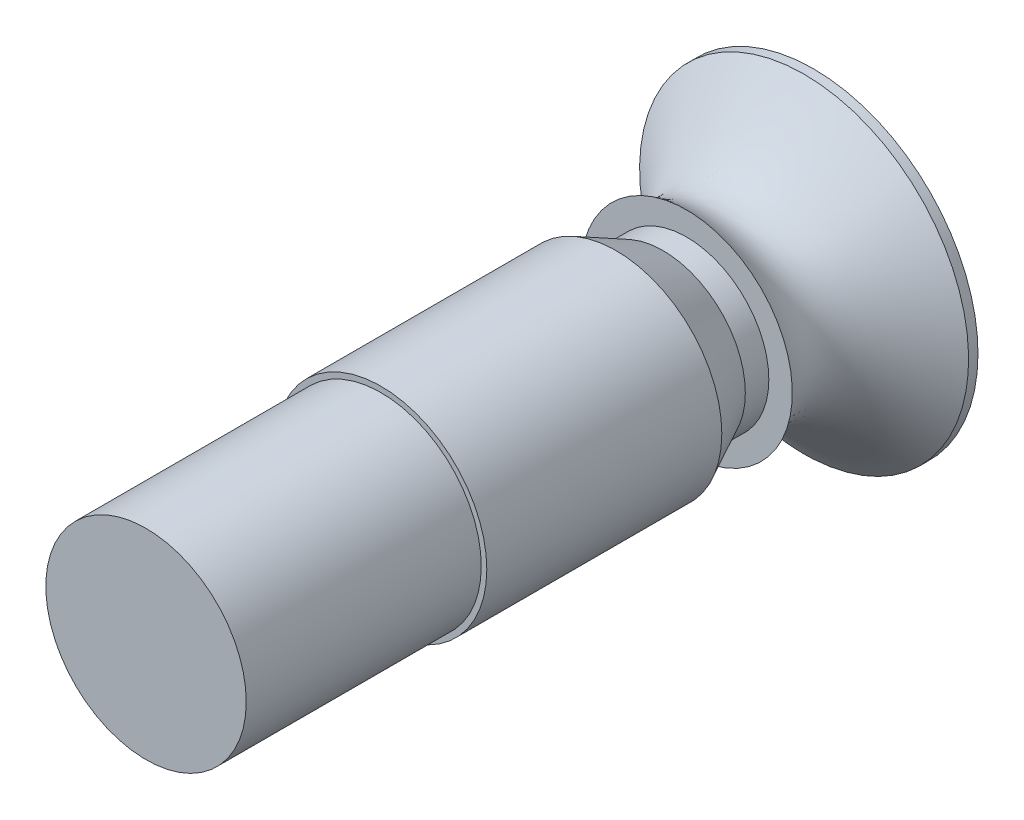
ISO-10303-21;
HEADER;
FILE_DESCRIPTION(('STEP AP214'),'2;1');
FILE_NAME('part.step','',(''),(''),'','','');
FILE_SCHEMA(('AUTOMOTIVE_DESIGN { 1 0 10303 214 1 1 1 1 }'));
ENDSEC;
DATA;
#1=APPLICATION_CONTEXT('core data for automotive mechanical design processes');
#2=APPLICATION_PROTOCOL_DEFINITION('international standard','automotive_design',2000,#1);
#3=PRODUCT_CONTEXT('',#1,'mechanical');
#4=PRODUCT('Part','Part','',(#3));
#5=PRODUCT_RELATED_PRODUCT_CATEGORY('part','',(#4));
#6=PRODUCT_DEFINITION_FORMATION('','',#4);
#7=PRODUCT_DEFINITION_CONTEXT('part definition',#1,'design');
#8=PRODUCT_DEFINITION('design','',#6,#7);
#9=PRODUCT_DEFINITION_SHAPE('','',#8);
#10=(LENGTH_UNIT() NAMED_UNIT(*) SI_UNIT(.MILLI.,.METRE.));
#11=(NAMED_UNIT(*) PLANE_ANGLE_UNIT() SI_UNIT($,.RADIAN.));
#12=(NAMED_UNIT(*) SI_UNIT($,.STERADIAN.) SOLID_ANGLE_UNIT());
#13=UNCERTAINTY_MEASURE_WITH_UNIT(LENGTH_MEASURE(1.E-05),#10,'distance_accuracy_value','');
#14=(GEOMETRIC_REPRESENTATION_CONTEXT(3) GLOBAL_UNCERTAINTY_ASSIGNED_CONTEXT((#13)) GLOBAL_UNIT_ASSIGNED_CONTEXT((#10,
#11,#12)) REPRESENTATION_CONTEXT('',''));
#15=CARTESIAN_POINT('',(0.,0.,0.));
#16=DIRECTION('',(0.,0.,1.));
#17=DIRECTION('',(1.,0.,0.));
#18=AXIS2_PLACEMENT_3D('',#15,#16,#17);
#19=CARTESIAN_POINT('',(0.,0.,2.));
#20=DIRECTION('',(0.,0.,-1.));
#21=DIRECTION('',(-1.,0.,0.));
#22=AXIS2_PLACEMENT_3D('',#19,#20,#21);
#23=CYLINDRICAL_SURFACE('',#22,35.);
#24=CARTESIAN_POINT('',(0.,0.,2.));
#25=DIRECTION('',(0.,0.,-1.));
#26=DIRECTION('',(-1.,0.,0.));
#27=AXIS2_PLACEMENT_3D('',#24,#25,#26);
#28=CIRCLE('',#27,35.);
#29=CARTESIAN_POINT('',(10.5013967184447,33.3874327698588,2.));
#30=VERTEX_POINT('',#29);
#31=EDGE_CURVE('E50',#30,#30,#28,.F.);
#32=ORIENTED_EDGE('',*,*,#31,.F.);
#33=EDGE_LOOP('',(#32));
#34=FACE_BOUND('',#33,.T.);
#35=CARTESIAN_POINT('',(0.,0.,0.));
#36=DIRECTION('',(0.,0.,1.));
#37=DIRECTION('',(1.,0.,0.));
#38=AXIS2_PLACEMENT_3D('',#35,#36,#37);
#39=CIRCLE('',#38,35.);
#40=CARTESIAN_POINT('',(35.,0.,0.));
#41=VERTEX_POINT('',#40);
#42=EDGE_CURVE('E107',#41,#41,#39,.T.);
#43=ORIENTED_EDGE('',*,*,#42,.T.);
#44=EDGE_LOOP('',(#43));
#45=FACE_BOUND('',#44,.T.);
#46=ADVANCED_FACE('F37',(#34,#45),#23,.T.);
#47=CARTESIAN_POINT('',(0.,0.,0.));
#48=DIRECTION('',(0.,0.,1.));
#49=DIRECTION('',(1.,0.,0.));
#50=AXIS2_PLACEMENT_3D('',#47,#48,#49);
#51=PLANE('',#50);
#52=ORIENTED_EDGE('',*,*,#42,.F.);
#53=EDGE_LOOP('',(#52));
#54=FACE_BOUND('',#53,.T.);
#55=ADVANCED_FACE('F88',(#54),#51,.F.);
#56=CARTESIAN_POINT('',(0.,0.,27.));
#57=DIRECTION('',(0.,0.,1.));
#58=DIRECTION('',(1.,0.,0.));
#59=AXIS2_PLACEMENT_3D('',#56,#57,#58);
#60=PLANE('',#59);
#61=CARTESIAN_POINT('',(0.,0.,27.));
#62=DIRECTION('',(0.,0.,1.));
#63=DIRECTION('',(1.,0.,0.));
#64=AXIS2_PLACEMENT_3D('',#61,#62,#63);
#65=CIRCLE('',#64,17.5);
#66=CARTESIAN_POINT('',(17.5,0.,27.));
#67=VERTEX_POINT('',#66);
#68=EDGE_CURVE('E45',#67,#67,#65,.T.);
#69=ORIENTED_EDGE('',*,*,#68,.F.);
#70=EDGE_LOOP('',(#69));
#71=FACE_BOUND('',#70,.T.);
#72=CARTESIAN_POINT('',(0.,0.,27.));
#73=DIRECTION('',(0.,0.,1.));
#74=DIRECTION('',(1.,0.,0.));
#75=AXIS2_PLACEMENT_3D('',#72,#73,#74);
#76=CIRCLE('',#75,22.5);
#77=CARTESIAN_POINT('',(-20.8303071685789,8.50578057926777,27.));
#78=VERTEX_POINT('',#77);
#79=EDGE_CURVE('E100',#78,#78,#76,.T.);
#80=ORIENTED_EDGE('',*,*,#79,.T.);
#81=EDGE_LOOP('',(#80));
#82=FACE_BOUND('',#81,.T.);
#83=ADVANCED_FACE('F84',(#71,#82),#60,.T.);
#84=CARTESIAN_POINT('',(-20.8303071685789,8.50578057926777,27.));
#85=CARTESIAN_POINT('',(10.5013967184447,33.3874327698588,2.));
#86=CARTESIAN_POINT('',(-3.81874601004341,50.1663949164257,27.));
#87=CARTESIAN_POINT('',(77.2762622581622,12.3846393329695,2.));
#88=CARTESIAN_POINT('',(37.8418683271145,33.1548337578901,27.));
#89=CARTESIAN_POINT('',(56.2734688212729,-54.3902262067481,2.));
#90=CARTESIAN_POINT('',(20.8303071685789,-8.50578057926777,27.));
#91=CARTESIAN_POINT('',(-10.5013967184447,-33.3874327698588,2.));
#92=CARTESIAN_POINT('',(3.81874601004339,-50.1663949164257,27.));
#93=CARTESIAN_POINT('',(-77.2762622581622,-12.3846393329695,2.));
#94=CARTESIAN_POINT('',(-37.8418683271145,-33.1548337578901,27.));
#95=CARTESIAN_POINT('',(-56.2734688212729,54.3902262067481,2.));
#96=CARTESIAN_POINT('',(-20.8303071685789,8.50578057926777,27.));
#97=CARTESIAN_POINT('',(10.5013967184447,33.3874327698588,2.));
#98=(BOUNDED_SURFACE() B_SPLINE_SURFACE(3,1,((#84,#85),(#86,#87),(#88,#89),(#90,#91),(#92,#93),
(#94,#95),(#96,#97)),.UNSPECIFIED.,.T.,.F.,.F.) B_SPLINE_SURFACE_WITH_KNOTS((4,3,4),(2,2),(0.,
0.5,1.),(0.,1.),.UNSPECIFIED.) GEOMETRIC_REPRESENTATION_ITEM() RATIONAL_B_SPLINE_SURFACE(((1.,
1.),(0.333333333333333,0.333333333333333),(0.333333333333333,0.333333333333333),(1.,1.),
(0.333333333333333,0.333333333333333),(0.333333333333333,0.333333333333333),(1.,1.))) REPRESENTATION_ITEM('') SURFACE());
#99=CARTESIAN_POINT('',(-20.8303071685789,8.50578057926777,27.));
#100=CARTESIAN_POINT('',(-20.5039352530891,8.76496445625309,26.7395833333333));
#101=CARTESIAN_POINT('',(-20.1775633375993,9.02414833323841,26.4791666666667));
#102=CARTESIAN_POINT('',(-19.5248195066196,9.54251608720906,25.9583333333333));
#103=CARTESIAN_POINT('',(-19.1984475911298,9.80169996419438,25.6979166666667));
#104=CARTESIAN_POINT('',(-18.5457037601501,10.320067718165,25.1770833333333));
#105=CARTESIAN_POINT('',(-18.2193318446603,10.5792515951504,24.9166666666667));
#106=CARTESIAN_POINT('',(-17.5665880136807,11.097619349121,24.3958333333333));
#107=CARTESIAN_POINT('',(-17.2402160981908,11.3568032261063,24.1354166666667));
#108=CARTESIAN_POINT('',(-16.5874722672112,11.875170980077,23.6145833333333));
#109=CARTESIAN_POINT('',(-16.2611003517213,12.1343548570623,23.3541666666667));
#110=CARTESIAN_POINT('',(-15.6083565207417,12.6527226110329,22.8333333333333));
#111=CARTESIAN_POINT('',(-15.2819846052518,12.9119064880183,22.5729166666667));
#112=CARTESIAN_POINT('',(-14.6292407742722,13.4302742419889,22.0520833333333));
#113=CARTESIAN_POINT('',(-14.3028688587824,13.6894581189742,21.7916666666667));
#114=CARTESIAN_POINT('',(-13.6501250278027,14.2078258729449,21.2708333333333));
#115=CARTESIAN_POINT('',(-13.3237531123129,14.4670097499302,21.0104166666667));
#116=CARTESIAN_POINT('',(-12.6710092813332,14.9853775039008,20.4895833333333));
#117=CARTESIAN_POINT('',(-12.3446373658434,15.2445613808862,20.2291666666667));
#118=CARTESIAN_POINT('',(-11.6918935348637,15.7629291348568,19.7083333333333));
#119=CARTESIAN_POINT('',(-11.3655216193739,16.0221130118421,19.4479166666667));
#120=CARTESIAN_POINT('',(-10.7127777883942,16.5404807658128,18.9270833333333));
#121=CARTESIAN_POINT('',(-10.3864058729044,16.7996646427981,18.6666666666667));
#122=CARTESIAN_POINT('',(-9.73366204192475,17.3180323967688,18.1458333333333));
#123=CARTESIAN_POINT('',(-9.40729012643492,17.5772162737541,17.8854166666667));
#124=CARTESIAN_POINT('',(-8.75454629545526,18.0955840277247,17.3645833333333));
#125=CARTESIAN_POINT('',(-8.42817437996543,18.35476790471,17.1041666666667));
#126=CARTESIAN_POINT('',(-7.77543054898577,18.8731356586807,16.5833333333333));
#127=CARTESIAN_POINT('',(-7.44905863349594,19.132319535666,16.3229166666667));
#128=CARTESIAN_POINT('',(-6.79631480251629,19.6506872896367,15.8020833333333));
#129=CARTESIAN_POINT('',(-6.46994288702646,19.909871166622,15.5416666666667));
#130=CARTESIAN_POINT('',(-5.8171990560468,20.4282389205926,15.0208333333333));
#131=CARTESIAN_POINT('',(-5.49082714055697,20.687422797578,14.7604166666667));
#132=CARTESIAN_POINT('',(-4.83808330957731,21.2057905515486,14.2395833333333));
#133=CARTESIAN_POINT('',(-4.51171139408748,21.4649744285339,13.9791666666667));
#134=CARTESIAN_POINT('',(-3.85896756310782,21.9833421825046,13.4583333333333));
#135=CARTESIAN_POINT('',(-3.53259564761799,22.2425260594899,13.1979166666667));
#136=CARTESIAN_POINT('',(-2.87985181663834,22.7608938134605,12.6770833333333));
#137=CARTESIAN_POINT('',(-2.55347990114851,23.0200776904459,12.4166666666667));
#138=CARTESIAN_POINT('',(-1.90073607016885,23.5384454444165,11.8958333333333));
#139=CARTESIAN_POINT('',(-1.57436415467902,23.7976293214018,11.6354166666667));
#140=CARTESIAN_POINT('',(-0.92162032369936,24.3159970753725,11.1145833333333));
#141=CARTESIAN_POINT('',(-0.59524840820953,24.5751809523578,10.8541666666667));
#142=CARTESIAN_POINT('',(0.0574954227701275,25.0935487063285,10.3333333333333));
#143=CARTESIAN_POINT('',(0.383867338259957,25.3527325833138,10.0729166666667));
#144=CARTESIAN_POINT('',(1.03661116923962,25.8711003372844,9.55208333333333));
#145=CARTESIAN_POINT('',(1.36298308472945,26.1302842142697,9.29166666666667));
#146=CARTESIAN_POINT('',(2.0157269157091,26.6486519682404,8.77083333333333));
#147=CARTESIAN_POINT('',(2.34209883119893,26.9078358452257,8.51041666666667));
#148=CARTESIAN_POINT('',(2.99484266217859,27.4262035991964,7.98958333333333));
#149=CARTESIAN_POINT('',(3.32121457766842,27.6853874761817,7.72916666666667));
#150=CARTESIAN_POINT('',(3.97395840864808,28.2037552301523,7.20833333333333));
#151=CARTESIAN_POINT('',(4.30033032413791,28.4629391071377,6.94791666666667));
#152=CARTESIAN_POINT('',(4.95307415511757,28.9813068611083,6.42708333333333));
#153=CARTESIAN_POINT('',(5.2794460706074,29.2404907380936,6.16666666666667));
#154=CARTESIAN_POINT('',(5.93218990158705,29.7588584920643,5.64583333333333));
#155=CARTESIAN_POINT('',(6.25856181707688,30.0180423690496,5.38541666666667));
#156=CARTESIAN_POINT('',(6.91130564805654,30.5364101230202,4.86458333333333));
#157=CARTESIAN_POINT('',(7.23767756354637,30.7955940000056,4.60416666666667));
#158=CARTESIAN_POINT('',(7.89042139452603,31.3139617539762,4.08333333333333));
#159=CARTESIAN_POINT('',(8.21679331001586,31.5731456309615,3.82291666666667));
#160=CARTESIAN_POINT('',(8.86953714099552,32.0915133849322,3.30208333333333));
#161=CARTESIAN_POINT('',(9.19590905648535,32.3506972619175,3.04166666666667));
#162=CARTESIAN_POINT('',(9.84865288746501,32.8690650158881,2.52083333333333));
#163=CARTESIAN_POINT('',(10.1750248029548,33.1282488928735,2.26041666666667));
#164=CARTESIAN_POINT('',(10.5013967184447,33.3874327698588,2.));
#165=B_SPLINE_CURVE_WITH_KNOTS('',3,(#99,#100,#101,#102,#103,#104,#105,#106,#107,#108,#109,#110,
#111,#112,#113,#114,#115,#116,#117,#118,#119,#120,#121,#122,#123,#124,#125,#126,#127,#128,#129,
#130,#131,#132,#133,#134,#135,#136,#137,#138,#139,#140,#141,#142,#143,#144,#145,#146,#147,#148,
#149,#150,#151,#152,#153,#154,#155,#156,#157,#158,#159,#160,#161,#162,#163,#164),.UNSPECIFIED.,
.F.,.F.,(4,2,2,2,2,2,2,2,2,2,2,2,2,2,2,2,2,2,2,2,2,2,2,2,2,2,2,2,2,2,2,2,4),(0.,
1.47431534831826,2.94863069663652,4.42294604495478,5.89726139327304,7.3715767415913,
8.84589208990956,10.3202074382278,11.7945227865461,13.2688381348643,14.7431534831826,
16.2174688315009,17.6917841798191,19.1660995281374,20.6404148764556,22.1147302247739,
23.5890455730922,25.0633609214104,26.5376762697287,28.0119916180469,29.4863069663652,
30.9606223146835,32.4349376630017,33.90925301132,35.3835683596382,36.8578837079565,
38.3321990562748,39.806514404593,41.2808297529113,42.7551451012295,44.2294604495478,
45.7037757978661,47.1780911461843),.UNSPECIFIED.);
#166=EDGE_CURVE('BSEAM82',#78,#30,#165,.T.);
#167=ORIENTED_EDGE('',*,*,#79,.F.);
#168=ORIENTED_EDGE('',*,*,#31,.T.);
#169=ORIENTED_EDGE('',*,*,#166,.T.);
#170=ORIENTED_EDGE('',*,*,#166,.F.);
#171=EDGE_LOOP('',(#167,#169,#168,#170));
#172=FACE_BOUND('',#171,.T.);
#173=ADVANCED_FACE('F82',(#172),#98,.T.);
#174=CARTESIAN_POINT('',(0.,0.,32.));
#175=DIRECTION('',(0.,0.,-1.));
#176=DIRECTION('',(-1.,0.,0.));
#177=AXIS2_PLACEMENT_3D('',#174,#175,#176);
#178=CYLINDRICAL_SURFACE('',#177,17.5);
#179=CARTESIAN_POINT('',(0.,0.,32.));
#180=DIRECTION('',(0.,0.,1.));
#181=DIRECTION('',(1.,0.,0.));
#182=AXIS2_PLACEMENT_3D('',#179,#180,#181);
#183=CIRCLE('',#182,17.5);
#184=CARTESIAN_POINT('',(17.5,0.,32.));
#185=VERTEX_POINT('',#184);
#186=EDGE_CURVE('E108',#185,#185,#183,.T.);
#187=ORIENTED_EDGE('',*,*,#186,.F.);
#188=EDGE_LOOP('',(#187));
#189=FACE_BOUND('',#188,.T.);
#190=ORIENTED_EDGE('',*,*,#68,.T.);
#191=EDGE_LOOP('',(#190));
#192=FACE_BOUND('',#191,.T.);
#193=ADVANCED_FACE('F77',(#189,#192),#178,.T.);
#194=CARTESIAN_POINT('',(0.,0.,32.));
#195=DIRECTION('',(0.,0.,1.));
#196=DIRECTION('',(1.,0.,0.));
#197=AXIS2_PLACEMENT_3D('',#194,#195,#196);
#198=CONICAL_SURFACE('',#197,17.5,0.463647609000806);
#199=CARTESIAN_POINT('',(0.,0.,42.));
#200=DIRECTION('',(0.,0.,1.));
#201=DIRECTION('',(1.,0.,0.));
#202=AXIS2_PLACEMENT_3D('',#199,#200,#201);
#203=CIRCLE('',#202,22.5);
#204=CARTESIAN_POINT('',(22.5,0.,42.));
#205=VERTEX_POINT('',#204);
#206=EDGE_CURVE('E40',#205,#205,#203,.T.);
#207=ORIENTED_EDGE('',*,*,#206,.F.);
#208=EDGE_LOOP('',(#207));
#209=FACE_BOUND('',#208,.T.);
#210=ORIENTED_EDGE('',*,*,#186,.T.);
#211=EDGE_LOOP('',(#210));
#212=FACE_BOUND('',#211,.T.);
#213=ADVANCED_FACE('F66',(#209,#212),#198,.T.);
#214=CARTESIAN_POINT('',(0.,0.,92.));
#215=DIRECTION('',(0.,0.,-1.));
#216=DIRECTION('',(-1.,0.,0.));
#217=AXIS2_PLACEMENT_3D('',#214,#215,#216);
#218=CYLINDRICAL_SURFACE('',#217,22.5);
#219=CARTESIAN_POINT('',(0.,0.,92.));
#220=DIRECTION('',(0.,0.,1.));
#221=DIRECTION('',(1.,0.,0.));
#222=AXIS2_PLACEMENT_3D('',#219,#220,#221);
#223=CIRCLE('',#222,22.5);
#224=CARTESIAN_POINT('',(22.5,0.,92.));
#225=VERTEX_POINT('',#224);
#226=EDGE_CURVE('E55',#225,#225,#223,.T.);
#227=ORIENTED_EDGE('',*,*,#226,.F.);
#228=EDGE_LOOP('',(#227));
#229=FACE_BOUND('',#228,.T.);
#230=ORIENTED_EDGE('',*,*,#206,.T.);
#231=EDGE_LOOP('',(#230));
#232=FACE_BOUND('',#231,.T.);
#233=ADVANCED_FACE('F76',(#229,#232),#218,.T.);
#234=CARTESIAN_POINT('',(0.,0.,92.));
#235=DIRECTION('',(0.,0.,1.));
#236=DIRECTION('',(1.,0.,0.));
#237=AXIS2_PLACEMENT_3D('',#234,#235,#236);
#238=PLANE('',#237);
#239=CARTESIAN_POINT('',(0.,0.,92.));
#240=DIRECTION('',(0.,0.,1.));
#241=DIRECTION('',(1.,0.,0.));
#242=AXIS2_PLACEMENT_3D('',#239,#240,#241);
#243=CIRCLE('',#242,21.322035413716);
#244=CARTESIAN_POINT('',(21.322035413716,0.,92.));
#245=VERTEX_POINT('',#244);
#246=EDGE_CURVE('E11',#245,#245,#243,.T.);
#247=ORIENTED_EDGE('',*,*,#246,.F.);
#248=EDGE_LOOP('',(#247));
#249=FACE_BOUND('',#248,.T.);
#250=ORIENTED_EDGE('',*,*,#226,.T.);
#251=EDGE_LOOP('',(#250));
#252=FACE_BOUND('',#251,.T.);
#253=ADVANCED_FACE('F130',(#249,#252),#238,.T.);
#254=CARTESIAN_POINT('',(0.,0.,142.));
#255=DIRECTION('',(0.,0.,-1.));
#256=DIRECTION('',(-1.,0.,0.));
#257=AXIS2_PLACEMENT_3D('',#254,#255,#256);
#258=CYLINDRICAL_SURFACE('',#257,21.322035413716);
#259=CARTESIAN_POINT('',(0.,0.,142.));
#260=DIRECTION('',(0.,0.,1.));
#261=DIRECTION('',(1.,0.,0.));
#262=AXIS2_PLACEMENT_3D('',#259,#260,#261);
#263=CIRCLE('',#262,21.322035413716);
#264=CARTESIAN_POINT('',(21.322035413716,0.,142.));
#265=VERTEX_POINT('',#264);
#266=EDGE_CURVE('E54',#265,#265,#263,.T.);
#267=ORIENTED_EDGE('',*,*,#266,.F.);
#268=EDGE_LOOP('',(#267));
#269=FACE_BOUND('',#268,.T.);
#270=ORIENTED_EDGE('',*,*,#246,.T.);
#271=EDGE_LOOP('',(#270));
#272=FACE_BOUND('',#271,.T.);
#273=ADVANCED_FACE('F135',(#269,#272),#258,.T.);
#274=CARTESIAN_POINT('',(0.,0.,142.));
#275=DIRECTION('',(0.,0.,1.));
#276=DIRECTION('',(1.,0.,0.));
#277=AXIS2_PLACEMENT_3D('',#274,#275,#276);
#278=PLANE('',#277);
#279=ORIENTED_EDGE('',*,*,#266,.T.);
#280=EDGE_LOOP('',(#279));
#281=FACE_BOUND('',#280,.T.);
#282=ADVANCED_FACE('F191',(#281),#278,.T.);
#283=CLOSED_SHELL('',(#46,#55,#83,#173,#193,#213,#233,#253,#273,#282));
#284=MANIFOLD_SOLID_BREP('B2',#283);
#285=ADVANCED_BREP_SHAPE_REPRESENTATION('',(#18,#284),#14);
#286=SHAPE_DEFINITION_REPRESENTATION(#9,#285);
ENDSEC;
END-ISO-10303-21;
